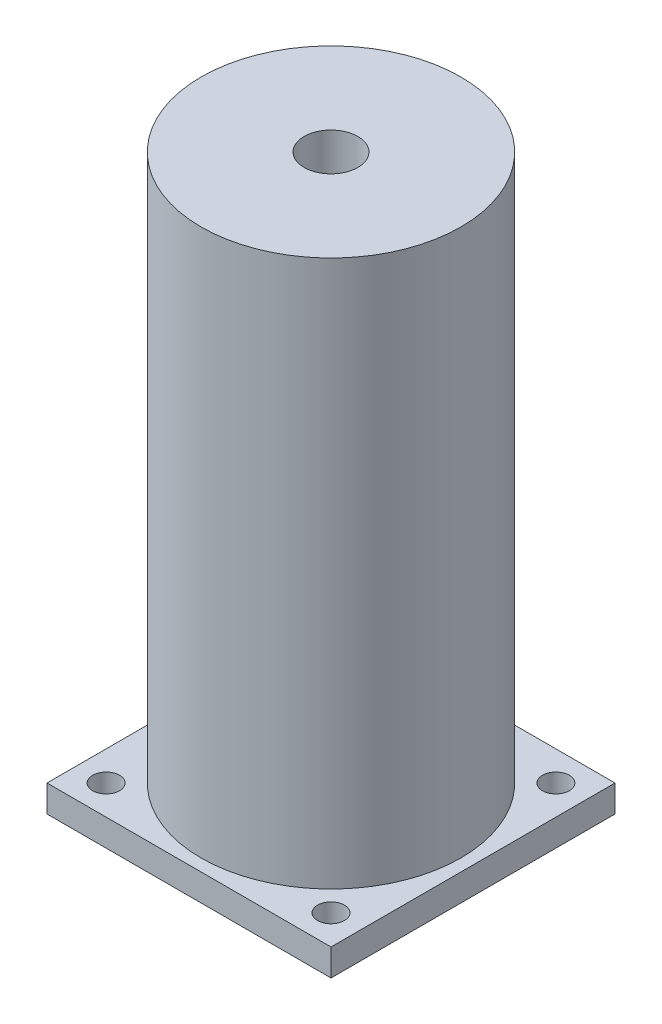
ISO-10303-21;
HEADER;
FILE_DESCRIPTION(('STEP AP214'),'2;1');
FILE_NAME('part.step','',(''),(''),'','','');
FILE_SCHEMA(('AUTOMOTIVE_DESIGN { 1 0 10303 214 1 1 1 1 }'));
ENDSEC;
DATA;
#1=APPLICATION_CONTEXT('core data for automotive mechanical design processes');
#2=APPLICATION_PROTOCOL_DEFINITION('international standard','automotive_design',2000,#1);
#3=PRODUCT_CONTEXT('',#1,'mechanical');
#4=PRODUCT('Part','Part','',(#3));
#5=PRODUCT_RELATED_PRODUCT_CATEGORY('part','',(#4));
#6=PRODUCT_DEFINITION_FORMATION('','',#4);
#7=PRODUCT_DEFINITION_CONTEXT('part definition',#1,'design');
#8=PRODUCT_DEFINITION('design','',#6,#7);
#9=PRODUCT_DEFINITION_SHAPE('','',#8);
#10=(LENGTH_UNIT() NAMED_UNIT(*) SI_UNIT(.MILLI.,.METRE.));
#11=(NAMED_UNIT(*) PLANE_ANGLE_UNIT() SI_UNIT($,.RADIAN.));
#12=(NAMED_UNIT(*) SI_UNIT($,.STERADIAN.) SOLID_ANGLE_UNIT());
#13=UNCERTAINTY_MEASURE_WITH_UNIT(LENGTH_MEASURE(1.E-05),#10,'distance_accuracy_value','');
#14=(GEOMETRIC_REPRESENTATION_CONTEXT(3) GLOBAL_UNCERTAINTY_ASSIGNED_CONTEXT((#13)) GLOBAL_UNIT_ASSIGNED_CONTEXT((#10,
#11,#12)) REPRESENTATION_CONTEXT('',''));
#15=CARTESIAN_POINT('',(0.,0.,0.));
#16=DIRECTION('',(0.,0.,1.));
#17=DIRECTION('',(1.,0.,0.));
#18=AXIS2_PLACEMENT_3D('',#15,#16,#17);
#19=CARTESIAN_POINT('',(15.85,3.,15.85));
#20=DIRECTION('',(-1.,0.,0.));
#21=DIRECTION('',(0.,0.,1.));
#22=AXIS2_PLACEMENT_3D('',#19,#20,#21);
#23=PLANE('',#22);
#24=DIRECTION('',(0.,0.,-1.));
#25=VECTOR('',#24,1.);
#26=CARTESIAN_POINT('',(15.85,0.,15.85));
#27=LINE('',#26,#25);
#28=CARTESIAN_POINT('',(15.85,0.,15.85));
#29=VERTEX_POINT('',#28);
#30=CARTESIAN_POINT('',(15.85,0.,-15.85));
#31=VERTEX_POINT('',#30);
#32=EDGE_CURVE('E106',#29,#31,#27,.T.);
#33=ORIENTED_EDGE('',*,*,#32,.T.);
#34=DIRECTION('',(0.,-1.,0.));
#35=VECTOR('',#34,1.);
#36=CARTESIAN_POINT('',(15.85,3.,-15.85));
#37=LINE('',#36,#35);
#38=CARTESIAN_POINT('',(15.85,3.,-15.85));
#39=VERTEX_POINT('',#38);
#40=EDGE_CURVE('E47',#39,#31,#37,.T.);
#41=ORIENTED_EDGE('',*,*,#40,.F.);
#42=DIRECTION('',(0.,0.,-1.));
#43=VECTOR('',#42,1.);
#44=CARTESIAN_POINT('',(15.85,3.,15.85));
#45=LINE('',#44,#43);
#46=CARTESIAN_POINT('',(15.85,3.,15.85));
#47=VERTEX_POINT('',#46);
#48=EDGE_CURVE('E92',#47,#39,#45,.T.);
#49=ORIENTED_EDGE('',*,*,#48,.F.);
#50=DIRECTION('',(0.,-1.,0.));
#51=VECTOR('',#50,1.);
#52=CARTESIAN_POINT('',(15.85,3.,15.85));
#53=LINE('',#52,#51);
#54=EDGE_CURVE('E102',#47,#29,#53,.T.);
#55=ORIENTED_EDGE('',*,*,#54,.T.);
#56=EDGE_LOOP('',(#33,#41,#49,#55));
#57=FACE_BOUND('',#56,.T.);
#58=ADVANCED_FACE('F38',(#57),#23,.F.);
#59=CARTESIAN_POINT('',(-15.85,3.,-15.85));
#60=DIRECTION('',(0.,0.,1.));
#61=DIRECTION('',(1.,0.,0.));
#62=AXIS2_PLACEMENT_3D('',#59,#60,#61);
#63=PLANE('',#62);
#64=DIRECTION('',(-1.,0.,0.));
#65=VECTOR('',#64,1.);
#66=CARTESIAN_POINT('',(-15.85,0.,-15.85));
#67=LINE('',#66,#65);
#68=CARTESIAN_POINT('',(-15.85,0.,-15.85));
#69=VERTEX_POINT('',#68);
#70=EDGE_CURVE('E97',#31,#69,#67,.T.);
#71=ORIENTED_EDGE('',*,*,#70,.T.);
#72=DIRECTION('',(0.,-1.,0.));
#73=VECTOR('',#72,1.);
#74=CARTESIAN_POINT('',(-15.85,3.,-15.85));
#75=LINE('',#74,#73);
#76=CARTESIAN_POINT('',(-15.85,3.,-15.85));
#77=VERTEX_POINT('',#76);
#78=EDGE_CURVE('E95',#77,#69,#75,.T.);
#79=ORIENTED_EDGE('',*,*,#78,.F.);
#80=DIRECTION('',(-1.,0.,0.));
#81=VECTOR('',#80,1.);
#82=CARTESIAN_POINT('',(-15.85,3.,-15.85));
#83=LINE('',#82,#81);
#84=EDGE_CURVE('E87',#39,#77,#83,.T.);
#85=ORIENTED_EDGE('',*,*,#84,.F.);
#86=ORIENTED_EDGE('',*,*,#40,.T.);
#87=EDGE_LOOP('',(#71,#79,#85,#86));
#88=FACE_BOUND('',#87,.T.);
#89=ADVANCED_FACE('F96',(#88),#63,.F.);
#90=CARTESIAN_POINT('',(-15.85,3.,15.85));
#91=DIRECTION('',(1.,0.,0.));
#92=DIRECTION('',(0.,0.,-1.));
#93=AXIS2_PLACEMENT_3D('',#90,#91,#92);
#94=PLANE('',#93);
#95=DIRECTION('',(0.,0.,1.));
#96=VECTOR('',#95,1.);
#97=CARTESIAN_POINT('',(-15.85,0.,15.85));
#98=LINE('',#97,#96);
#99=CARTESIAN_POINT('',(-15.85,0.,15.85));
#100=VERTEX_POINT('',#99);
#101=EDGE_CURVE('E73',#69,#100,#98,.T.);
#102=ORIENTED_EDGE('',*,*,#101,.T.);
#103=DIRECTION('',(0.,-1.,0.));
#104=VECTOR('',#103,1.);
#105=CARTESIAN_POINT('',(-15.85,3.,15.85));
#106=LINE('',#105,#104);
#107=CARTESIAN_POINT('',(-15.85,3.,15.85));
#108=VERTEX_POINT('',#107);
#109=EDGE_CURVE('E98',#108,#100,#106,.T.);
#110=ORIENTED_EDGE('',*,*,#109,.F.);
#111=DIRECTION('',(0.,0.,1.));
#112=VECTOR('',#111,1.);
#113=CARTESIAN_POINT('',(-15.85,3.,15.85));
#114=LINE('',#113,#112);
#115=EDGE_CURVE('E90',#77,#108,#114,.T.);
#116=ORIENTED_EDGE('',*,*,#115,.F.);
#117=ORIENTED_EDGE('',*,*,#78,.T.);
#118=EDGE_LOOP('',(#102,#110,#116,#117));
#119=FACE_BOUND('',#118,.T.);
#120=ADVANCED_FACE('F100',(#119),#94,.F.);
#121=CARTESIAN_POINT('',(-15.85,3.,15.85));
#122=DIRECTION('',(0.,0.,-1.));
#123=DIRECTION('',(-1.,0.,0.));
#124=AXIS2_PLACEMENT_3D('',#121,#122,#123);
#125=PLANE('',#124);
#126=DIRECTION('',(1.,0.,0.));
#127=VECTOR('',#126,1.);
#128=CARTESIAN_POINT('',(-15.85,0.,15.85));
#129=LINE('',#128,#127);
#130=EDGE_CURVE('E79',#100,#29,#129,.T.);
#131=ORIENTED_EDGE('',*,*,#130,.T.);
#132=ORIENTED_EDGE('',*,*,#54,.F.);
#133=DIRECTION('',(1.,0.,0.));
#134=VECTOR('',#133,1.);
#135=CARTESIAN_POINT('',(-15.85,3.,15.85));
#136=LINE('',#135,#134);
#137=EDGE_CURVE('E56',#108,#47,#136,.T.);
#138=ORIENTED_EDGE('',*,*,#137,.F.);
#139=ORIENTED_EDGE('',*,*,#109,.T.);
#140=EDGE_LOOP('',(#131,#132,#138,#139));
#141=FACE_BOUND('',#140,.T.);
#142=ADVANCED_FACE('F173',(#141),#125,.F.);
#143=CARTESIAN_POINT('',(0.,3.,0.));
#144=DIRECTION('',(0.,-1.,0.));
#145=DIRECTION('',(0.,0.,-1.));
#146=AXIS2_PLACEMENT_3D('',#143,#144,#145);
#147=PLANE('',#146);
#148=CARTESIAN_POINT('',(-12.5511453660612,3.,12.5511453660612));
#149=DIRECTION('',(0.,-1.,0.));
#150=DIRECTION('',(0.,0.,-1.));
#151=AXIS2_PLACEMENT_3D('',#148,#149,#150);
#152=CIRCLE('',#151,1.49999999999999);
#153=CARTESIAN_POINT('',(-12.5511453660612,3.,11.0511453660612));
#154=VERTEX_POINT('',#153);
#155=EDGE_CURVE('E41',#154,#154,#152,.T.);
#156=ORIENTED_EDGE('',*,*,#155,.T.);
#157=EDGE_LOOP('',(#156));
#158=FACE_BOUND('',#157,.T.);
#159=CARTESIAN_POINT('',(12.5511453660612,3.,12.5511453660612));
#160=DIRECTION('',(0.,-1.,0.));
#161=DIRECTION('',(0.,0.,-1.));
#162=AXIS2_PLACEMENT_3D('',#159,#160,#161);
#163=CIRCLE('',#162,1.49999999999999);
#164=CARTESIAN_POINT('',(12.5511453660612,3.,11.0511453660612));
#165=VERTEX_POINT('',#164);
#166=EDGE_CURVE('E133',#165,#165,#163,.T.);
#167=ORIENTED_EDGE('',*,*,#166,.T.);
#168=EDGE_LOOP('',(#167));
#169=FACE_BOUND('',#168,.T.);
#170=CARTESIAN_POINT('',(-12.5511453660612,3.,-12.5511453660612));
#171=DIRECTION('',(0.,-1.,0.));
#172=DIRECTION('',(0.,0.,-1.));
#173=AXIS2_PLACEMENT_3D('',#170,#171,#172);
#174=CIRCLE('',#173,1.49999999999999);
#175=CARTESIAN_POINT('',(-12.5511453660612,3.,-14.0511453660612));
#176=VERTEX_POINT('',#175);
#177=EDGE_CURVE('E123',#176,#176,#174,.T.);
#178=ORIENTED_EDGE('',*,*,#177,.T.);
#179=EDGE_LOOP('',(#178));
#180=FACE_BOUND('',#179,.T.);
#181=CARTESIAN_POINT('',(12.5511453660612,3.,-12.5511453660612));
#182=DIRECTION('',(0.,-1.,0.));
#183=DIRECTION('',(0.,0.,-1.));
#184=AXIS2_PLACEMENT_3D('',#181,#182,#183);
#185=CIRCLE('',#184,1.49999999999999);
#186=CARTESIAN_POINT('',(12.5511453660612,3.,-14.0511453660612));
#187=VERTEX_POINT('',#186);
#188=EDGE_CURVE('E115',#187,#187,#185,.T.);
#189=ORIENTED_EDGE('',*,*,#188,.T.);
#190=EDGE_LOOP('',(#189));
#191=FACE_BOUND('',#190,.T.);
#192=CARTESIAN_POINT('',(0.,3.,0.));
#193=DIRECTION('',(0.,1.,0.));
#194=DIRECTION('',(0.,0.,1.));
#195=AXIS2_PLACEMENT_3D('',#192,#193,#194);
#196=CIRCLE('',#195,14.5);
#197=CARTESIAN_POINT('',(0.,3.,14.5));
#198=VERTEX_POINT('',#197);
#199=EDGE_CURVE('E11',#198,#198,#196,.T.);
#200=ORIENTED_EDGE('',*,*,#199,.F.);
#201=EDGE_LOOP('',(#200));
#202=FACE_BOUND('',#201,.T.);
#203=ORIENTED_EDGE('',*,*,#48,.T.);
#204=ORIENTED_EDGE('',*,*,#84,.T.);
#205=ORIENTED_EDGE('',*,*,#115,.T.);
#206=ORIENTED_EDGE('',*,*,#137,.T.);
#207=EDGE_LOOP('',(#203,#204,#205,#206));
#208=FACE_BOUND('',#207,.T.);
#209=ADVANCED_FACE('F88',(#158,#169,#180,#191,#202,#208),#147,.F.);
#210=CARTESIAN_POINT('',(0.,0.,0.));
#211=DIRECTION('',(0.,-1.,0.));
#212=DIRECTION('',(0.,0.,-1.));
#213=AXIS2_PLACEMENT_3D('',#210,#211,#212);
#214=PLANE('',#213);
#215=CARTESIAN_POINT('',(0.,0.,0.));
#216=DIRECTION('',(0.,1.,0.));
#217=DIRECTION('',(0.,0.,1.));
#218=AXIS2_PLACEMENT_3D('',#215,#216,#217);
#219=CIRCLE('',#218,3.);
#220=CARTESIAN_POINT('',(0.,0.,3.));
#221=VERTEX_POINT('',#220);
#222=EDGE_CURVE('E142',#221,#221,#219,.T.);
#223=ORIENTED_EDGE('',*,*,#222,.T.);
#224=EDGE_LOOP('',(#223));
#225=FACE_BOUND('',#224,.T.);
#226=CARTESIAN_POINT('',(-12.5511453660612,0.,12.5511453660612));
#227=DIRECTION('',(0.,-1.,0.));
#228=DIRECTION('',(0.,0.,-1.));
#229=AXIS2_PLACEMENT_3D('',#226,#227,#228);
#230=CIRCLE('',#229,1.49999999999999);
#231=CARTESIAN_POINT('',(-12.5511453660612,0.,11.0511453660612));
#232=VERTEX_POINT('',#231);
#233=EDGE_CURVE('E139',#232,#232,#230,.T.);
#234=ORIENTED_EDGE('',*,*,#233,.F.);
#235=EDGE_LOOP('',(#234));
#236=FACE_BOUND('',#235,.T.);
#237=CARTESIAN_POINT('',(12.5511453660612,0.,12.5511453660612));
#238=DIRECTION('',(0.,-1.,0.));
#239=DIRECTION('',(0.,0.,-1.));
#240=AXIS2_PLACEMENT_3D('',#237,#238,#239);
#241=CIRCLE('',#240,1.49999999999999);
#242=CARTESIAN_POINT('',(12.5511453660612,0.,11.0511453660612));
#243=VERTEX_POINT('',#242);
#244=EDGE_CURVE('E136',#243,#243,#241,.T.);
#245=ORIENTED_EDGE('',*,*,#244,.F.);
#246=EDGE_LOOP('',(#245));
#247=FACE_BOUND('',#246,.T.);
#248=CARTESIAN_POINT('',(-12.5511453660612,0.,-12.5511453660612));
#249=DIRECTION('',(0.,-1.,0.));
#250=DIRECTION('',(0.,0.,-1.));
#251=AXIS2_PLACEMENT_3D('',#248,#249,#250);
#252=CIRCLE('',#251,1.49999999999999);
#253=CARTESIAN_POINT('',(-12.5511453660612,0.,-14.0511453660612));
#254=VERTEX_POINT('',#253);
#255=EDGE_CURVE('E128',#254,#254,#252,.T.);
#256=ORIENTED_EDGE('',*,*,#255,.F.);
#257=EDGE_LOOP('',(#256));
#258=FACE_BOUND('',#257,.T.);
#259=CARTESIAN_POINT('',(12.5511453660612,0.,-12.5511453660612));
#260=DIRECTION('',(0.,-1.,0.));
#261=DIRECTION('',(0.,0.,-1.));
#262=AXIS2_PLACEMENT_3D('',#259,#260,#261);
#263=CIRCLE('',#262,1.49999999999999);
#264=CARTESIAN_POINT('',(12.5511453660612,0.,-14.0511453660612));
#265=VERTEX_POINT('',#264);
#266=EDGE_CURVE('E117',#265,#265,#263,.T.);
#267=ORIENTED_EDGE('',*,*,#266,.F.);
#268=EDGE_LOOP('',(#267));
#269=FACE_BOUND('',#268,.T.);
#270=ORIENTED_EDGE('',*,*,#32,.F.);
#271=ORIENTED_EDGE('',*,*,#130,.F.);
#272=ORIENTED_EDGE('',*,*,#101,.F.);
#273=ORIENTED_EDGE('',*,*,#70,.F.);
#274=EDGE_LOOP('',(#270,#271,#272,#273));
#275=FACE_BOUND('',#274,.T.);
#276=ADVANCED_FACE('F149',(#225,#236,#247,#258,#269,#275),#214,.T.);
#277=CARTESIAN_POINT('',(0.,64.,0.));
#278=DIRECTION('',(0.,-1.,0.));
#279=DIRECTION('',(0.,0.,-1.));
#280=AXIS2_PLACEMENT_3D('',#277,#278,#279);
#281=CYLINDRICAL_SURFACE('',#280,14.5);
#282=CARTESIAN_POINT('',(0.,64.,0.));
#283=DIRECTION('',(0.,1.,0.));
#284=DIRECTION('',(0.,0.,1.));
#285=AXIS2_PLACEMENT_3D('',#282,#283,#284);
#286=CIRCLE('',#285,14.5);
#287=CARTESIAN_POINT('',(0.,64.,14.5));
#288=VERTEX_POINT('',#287);
#289=EDGE_CURVE('E109',#288,#288,#286,.T.);
#290=ORIENTED_EDGE('',*,*,#289,.F.);
#291=EDGE_LOOP('',(#290));
#292=FACE_BOUND('',#291,.T.);
#293=ORIENTED_EDGE('',*,*,#199,.T.);
#294=EDGE_LOOP('',(#293));
#295=FACE_BOUND('',#294,.T.);
#296=ADVANCED_FACE('F163',(#292,#295),#281,.T.);
#297=CARTESIAN_POINT('',(0.,64.,0.));
#298=DIRECTION('',(0.,1.,0.));
#299=DIRECTION('',(0.,0.,1.));
#300=AXIS2_PLACEMENT_3D('',#297,#298,#299);
#301=PLANE('',#300);
#302=CARTESIAN_POINT('',(0.,64.,0.));
#303=DIRECTION('',(0.,1.,0.));
#304=DIRECTION('',(0.,0.,1.));
#305=AXIS2_PLACEMENT_3D('',#302,#303,#304);
#306=CIRCLE('',#305,3.);
#307=CARTESIAN_POINT('',(0.,64.,3.));
#308=VERTEX_POINT('',#307);
#309=EDGE_CURVE('E143',#308,#308,#306,.T.);
#310=ORIENTED_EDGE('',*,*,#309,.F.);
#311=EDGE_LOOP('',(#310));
#312=FACE_BOUND('',#311,.T.);
#313=ORIENTED_EDGE('',*,*,#289,.T.);
#314=EDGE_LOOP('',(#313));
#315=FACE_BOUND('',#314,.T.);
#316=ADVANCED_FACE('F159',(#312,#315),#301,.T.);
#317=CARTESIAN_POINT('',(12.5511453660612,0.,-12.5511453660612));
#318=DIRECTION('',(0.,-1.,0.));
#319=DIRECTION('',(0.,0.,-1.));
#320=AXIS2_PLACEMENT_3D('',#317,#318,#319);
#321=CYLINDRICAL_SURFACE('',#320,1.49999999999999);
#322=ORIENTED_EDGE('',*,*,#266,.T.);
#323=EDGE_LOOP('',(#322));
#324=FACE_BOUND('',#323,.T.);
#325=ORIENTED_EDGE('',*,*,#188,.F.);
#326=EDGE_LOOP('',(#325));
#327=FACE_BOUND('',#326,.T.);
#328=ADVANCED_FACE('F162',(#324,#327),#321,.F.);
#329=CARTESIAN_POINT('',(-12.5511453660612,0.,-12.5511453660612));
#330=DIRECTION('',(0.,-1.,0.));
#331=DIRECTION('',(0.,0.,-1.));
#332=AXIS2_PLACEMENT_3D('',#329,#330,#331);
#333=CYLINDRICAL_SURFACE('',#332,1.49999999999999);
#334=ORIENTED_EDGE('',*,*,#255,.T.);
#335=EDGE_LOOP('',(#334));
#336=FACE_BOUND('',#335,.T.);
#337=ORIENTED_EDGE('',*,*,#177,.F.);
#338=EDGE_LOOP('',(#337));
#339=FACE_BOUND('',#338,.T.);
#340=ADVANCED_FACE('F222',(#336,#339),#333,.F.);
#341=CARTESIAN_POINT('',(12.5511453660612,0.,12.5511453660612));
#342=DIRECTION('',(0.,-1.,0.));
#343=DIRECTION('',(0.,0.,-1.));
#344=AXIS2_PLACEMENT_3D('',#341,#342,#343);
#345=CYLINDRICAL_SURFACE('',#344,1.49999999999999);
#346=ORIENTED_EDGE('',*,*,#244,.T.);
#347=EDGE_LOOP('',(#346));
#348=FACE_BOUND('',#347,.T.);
#349=ORIENTED_EDGE('',*,*,#166,.F.);
#350=EDGE_LOOP('',(#349));
#351=FACE_BOUND('',#350,.T.);
#352=ADVANCED_FACE('F231',(#348,#351),#345,.F.);
#353=CARTESIAN_POINT('',(-12.5511453660612,0.,12.5511453660612));
#354=DIRECTION('',(0.,-1.,0.));
#355=DIRECTION('',(0.,0.,-1.));
#356=AXIS2_PLACEMENT_3D('',#353,#354,#355);
#357=CYLINDRICAL_SURFACE('',#356,1.49999999999999);
#358=ORIENTED_EDGE('',*,*,#233,.T.);
#359=EDGE_LOOP('',(#358));
#360=FACE_BOUND('',#359,.T.);
#361=ORIENTED_EDGE('',*,*,#155,.F.);
#362=EDGE_LOOP('',(#361));
#363=FACE_BOUND('',#362,.T.);
#364=ADVANCED_FACE('F155',(#360,#363),#357,.F.);
#365=CARTESIAN_POINT('',(0.,0.,0.));
#366=DIRECTION('',(0.,1.,0.));
#367=DIRECTION('',(0.,0.,1.));
#368=AXIS2_PLACEMENT_3D('',#365,#366,#367);
#369=CYLINDRICAL_SURFACE('',#368,3.);
#370=ORIENTED_EDGE('',*,*,#222,.F.);
#371=EDGE_LOOP('',(#370));
#372=FACE_BOUND('',#371,.T.);
#373=ORIENTED_EDGE('',*,*,#309,.T.);
#374=EDGE_LOOP('',(#373));
#375=FACE_BOUND('',#374,.T.);
#376=ADVANCED_FACE('F152',(#372,#375),#369,.F.);
#377=CLOSED_SHELL('',(#58,#89,#120,#142,#209,#276,#296,#316,#328,#340,#352,#364,#376));
#378=MANIFOLD_SOLID_BREP('B2',#377);
#379=ADVANCED_BREP_SHAPE_REPRESENTATION('',(#18,#378),#14);
#380=SHAPE_DEFINITION_REPRESENTATION(#9,#379);
ENDSEC;
END-ISO-10303-21;
